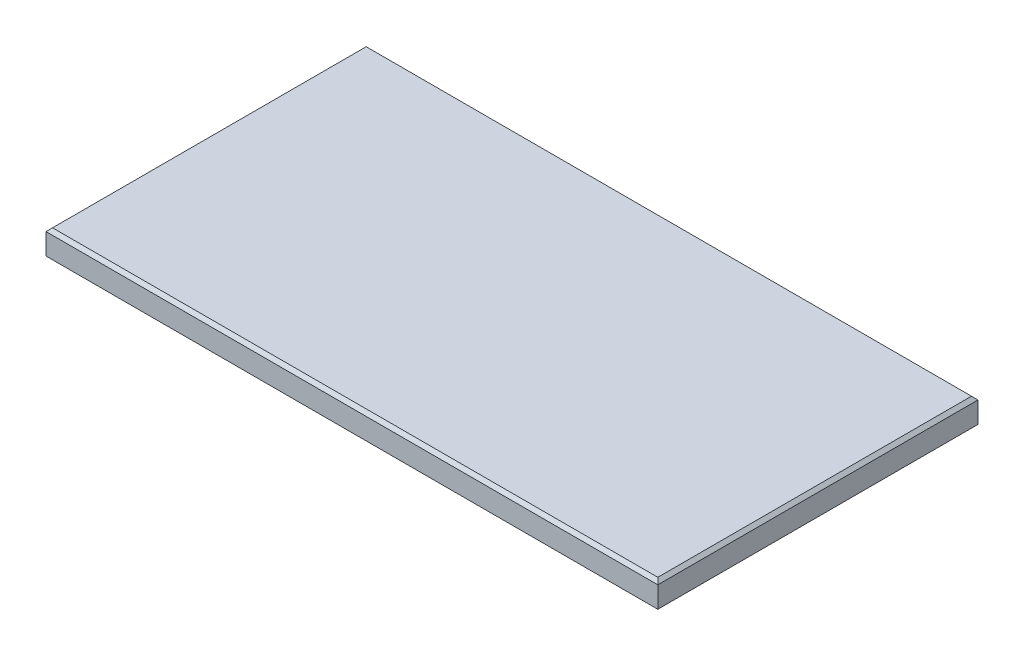
ISO-10303-21;
HEADER;
FILE_DESCRIPTION(('STEP AP214'),'2;1');
FILE_NAME('part.step','',(''),(''),'','','');
FILE_SCHEMA(('AUTOMOTIVE_DESIGN { 1 0 10303 214 1 1 1 1 }'));
ENDSEC;
DATA;
#1=APPLICATION_CONTEXT('core data for automotive mechanical design processes');
#2=APPLICATION_PROTOCOL_DEFINITION('international standard','automotive_design',2000,#1);
#3=PRODUCT_CONTEXT('',#1,'mechanical');
#4=PRODUCT('Part','Part','',(#3));
#5=PRODUCT_RELATED_PRODUCT_CATEGORY('part','',(#4));
#6=PRODUCT_DEFINITION_FORMATION('','',#4);
#7=PRODUCT_DEFINITION_CONTEXT('part definition',#1,'design');
#8=PRODUCT_DEFINITION('design','',#6,#7);
#9=PRODUCT_DEFINITION_SHAPE('','',#8);
#10=(LENGTH_UNIT() NAMED_UNIT(*) SI_UNIT(.MILLI.,.METRE.));
#11=(NAMED_UNIT(*) PLANE_ANGLE_UNIT() SI_UNIT($,.RADIAN.));
#12=(NAMED_UNIT(*) SI_UNIT($,.STERADIAN.) SOLID_ANGLE_UNIT());
#13=UNCERTAINTY_MEASURE_WITH_UNIT(LENGTH_MEASURE(1.E-05),#10,'distance_accuracy_value','');
#14=(GEOMETRIC_REPRESENTATION_CONTEXT(3) GLOBAL_UNCERTAINTY_ASSIGNED_CONTEXT((#13)) GLOBAL_UNIT_ASSIGNED_CONTEXT((#10,
#11,#12)) REPRESENTATION_CONTEXT('',''));
#15=CARTESIAN_POINT('',(0.,0.,0.));
#16=DIRECTION('',(0.,0.,1.));
#17=DIRECTION('',(1.,0.,0.));
#18=AXIS2_PLACEMENT_3D('',#15,#16,#17);
#19=CARTESIAN_POINT('',(0.,19.05,0.));
#20=DIRECTION('',(1.,0.,0.));
#21=DIRECTION('',(0.,0.,-1.));
#22=AXIS2_PLACEMENT_3D('',#19,#20,#21);
#23=PLANE('',#22);
#24=DIRECTION('',(0.,-1.,0.));
#25=VECTOR('',#24,1.);
#26=CARTESIAN_POINT('',(0.,19.05,0.));
#27=LINE('',#26,#25);
#28=CARTESIAN_POINT('',(0.,16.5100000000001,0.));
#29=VERTEX_POINT('',#28);
#30=CARTESIAN_POINT('',(0.,0.,0.));
#31=VERTEX_POINT('',#30);
#32=EDGE_CURVE('E93',#29,#31,#27,.T.);
#33=ORIENTED_EDGE('',*,*,#32,.F.);
#34=DIRECTION('',(0.,0.,-1.));
#35=VECTOR('',#34,1.);
#36=CARTESIAN_POINT('',(0.,16.5100000000001,0.));
#37=LINE('',#36,#35);
#38=CARTESIAN_POINT('',(0.,16.5100000000001,-249.2375));
#39=VERTEX_POINT('',#38);
#40=EDGE_CURVE('E11',#29,#39,#37,.T.);
#41=ORIENTED_EDGE('',*,*,#40,.T.);
#42=DIRECTION('',(0.,-1.,0.));
#43=VECTOR('',#42,1.);
#44=CARTESIAN_POINT('',(0.,19.05,-249.2375));
#45=LINE('',#44,#43);
#46=CARTESIAN_POINT('',(0.,0.,-249.2375));
#47=VERTEX_POINT('',#46);
#48=EDGE_CURVE('E113',#39,#47,#45,.T.);
#49=ORIENTED_EDGE('',*,*,#48,.T.);
#50=DIRECTION('',(0.,0.,1.));
#51=VECTOR('',#50,1.);
#52=CARTESIAN_POINT('',(0.,0.,0.));
#53=LINE('',#52,#51);
#54=EDGE_CURVE('E108',#47,#31,#53,.T.);
#55=ORIENTED_EDGE('',*,*,#54,.T.);
#56=EDGE_LOOP('',(#33,#41,#49,#55));
#57=FACE_BOUND('',#56,.T.);
#58=ADVANCED_FACE('F40',(#57),#23,.F.);
#59=CARTESIAN_POINT('',(0.,19.05,0.));
#60=DIRECTION('',(0.,0.,-1.));
#61=DIRECTION('',(-1.,0.,0.));
#62=AXIS2_PLACEMENT_3D('',#59,#60,#61);
#63=PLANE('',#62);
#64=DIRECTION('',(0.,-1.,0.));
#65=VECTOR('',#64,1.);
#66=CARTESIAN_POINT('',(476.25,19.05,0.));
#67=LINE('',#66,#65);
#68=CARTESIAN_POINT('',(476.25,16.5100000000001,0.));
#69=VERTEX_POINT('',#68);
#70=CARTESIAN_POINT('',(476.25,0.,0.));
#71=VERTEX_POINT('',#70);
#72=EDGE_CURVE('E102',#69,#71,#67,.T.);
#73=ORIENTED_EDGE('',*,*,#72,.F.);
#74=DIRECTION('',(-1.,0.,0.));
#75=VECTOR('',#74,1.);
#76=CARTESIAN_POINT('',(0.,16.5100000000001,0.));
#77=LINE('',#76,#75);
#78=EDGE_CURVE('E50',#69,#29,#77,.T.);
#79=ORIENTED_EDGE('',*,*,#78,.T.);
#80=ORIENTED_EDGE('',*,*,#32,.T.);
#81=DIRECTION('',(1.,0.,0.));
#82=VECTOR('',#81,1.);
#83=CARTESIAN_POINT('',(0.,0.,0.));
#84=LINE('',#83,#82);
#85=EDGE_CURVE('E96',#31,#71,#84,.T.);
#86=ORIENTED_EDGE('',*,*,#85,.T.);
#87=EDGE_LOOP('',(#73,#79,#80,#86));
#88=FACE_BOUND('',#87,.T.);
#89=ADVANCED_FACE('F95',(#88),#63,.F.);
#90=CARTESIAN_POINT('',(476.25,19.05,0.));
#91=DIRECTION('',(-1.,0.,0.));
#92=DIRECTION('',(0.,0.,1.));
#93=AXIS2_PLACEMENT_3D('',#90,#91,#92);
#94=PLANE('',#93);
#95=DIRECTION('',(0.,-1.,0.));
#96=VECTOR('',#95,1.);
#97=CARTESIAN_POINT('',(476.25,19.05,-249.2375));
#98=LINE('',#97,#96);
#99=CARTESIAN_POINT('',(476.25,16.5100000000001,-249.2375));
#100=VERTEX_POINT('',#99);
#101=CARTESIAN_POINT('',(476.25,0.,-249.2375));
#102=VERTEX_POINT('',#101);
#103=EDGE_CURVE('E123',#100,#102,#98,.T.);
#104=ORIENTED_EDGE('',*,*,#103,.F.);
#105=DIRECTION('',(0.,0.,1.));
#106=VECTOR('',#105,1.);
#107=CARTESIAN_POINT('',(476.25,16.5100000000001,0.));
#108=LINE('',#107,#106);
#109=EDGE_CURVE('E65',#100,#69,#108,.T.);
#110=ORIENTED_EDGE('',*,*,#109,.T.);
#111=ORIENTED_EDGE('',*,*,#72,.T.);
#112=DIRECTION('',(0.,0.,-1.));
#113=VECTOR('',#112,1.);
#114=CARTESIAN_POINT('',(476.25,0.,0.));
#115=LINE('',#114,#113);
#116=EDGE_CURVE('E110',#71,#102,#115,.T.);
#117=ORIENTED_EDGE('',*,*,#116,.T.);
#118=EDGE_LOOP('',(#104,#110,#111,#117));
#119=FACE_BOUND('',#118,.T.);
#120=ADVANCED_FACE('F161',(#119),#94,.F.);
#121=CARTESIAN_POINT('',(0.,19.05,-249.2375));
#122=DIRECTION('',(0.,0.,1.));
#123=DIRECTION('',(1.,0.,0.));
#124=AXIS2_PLACEMENT_3D('',#121,#122,#123);
#125=PLANE('',#124);
#126=ORIENTED_EDGE('',*,*,#48,.F.);
#127=DIRECTION('',(1.,0.,0.));
#128=VECTOR('',#127,1.);
#129=CARTESIAN_POINT('',(0.,16.5100000000001,-249.2375));
#130=LINE('',#129,#128);
#131=EDGE_CURVE('E134',#39,#100,#130,.T.);
#132=ORIENTED_EDGE('',*,*,#131,.T.);
#133=ORIENTED_EDGE('',*,*,#103,.T.);
#134=DIRECTION('',(-1.,0.,0.));
#135=VECTOR('',#134,1.);
#136=CARTESIAN_POINT('',(0.,0.,-249.2375));
#137=LINE('',#136,#135);
#138=EDGE_CURVE('E120',#102,#47,#137,.T.);
#139=ORIENTED_EDGE('',*,*,#138,.T.);
#140=EDGE_LOOP('',(#126,#132,#133,#139));
#141=FACE_BOUND('',#140,.T.);
#142=ADVANCED_FACE('F160',(#141),#125,.F.);
#143=CARTESIAN_POINT('',(0.,19.05,0.));
#144=DIRECTION('',(0.,-1.,0.));
#145=DIRECTION('',(0.,0.,-1.));
#146=AXIS2_PLACEMENT_3D('',#143,#144,#145);
#147=PLANE('',#146);
#148=DIRECTION('',(0.,0.,-1.));
#149=VECTOR('',#148,1.);
#150=CARTESIAN_POINT('',(473.71,19.05,0.));
#151=LINE('',#150,#149);
#152=CARTESIAN_POINT('',(473.71,19.05,-2.53999999999993));
#153=VERTEX_POINT('',#152);
#154=CARTESIAN_POINT('',(473.71,19.05,-246.6975));
#155=VERTEX_POINT('',#154);
#156=EDGE_CURVE('E129',#153,#155,#151,.T.);
#157=ORIENTED_EDGE('',*,*,#156,.T.);
#158=DIRECTION('',(-1.,0.,0.));
#159=VECTOR('',#158,1.);
#160=CARTESIAN_POINT('',(0.,19.05,-246.6975));
#161=LINE('',#160,#159);
#162=CARTESIAN_POINT('',(2.53999999999993,19.05,-246.6975));
#163=VERTEX_POINT('',#162);
#164=EDGE_CURVE('E131',#155,#163,#161,.T.);
#165=ORIENTED_EDGE('',*,*,#164,.T.);
#166=DIRECTION('',(0.,0.,1.));
#167=VECTOR('',#166,1.);
#168=CARTESIAN_POINT('',(2.53999999999993,19.05,0.));
#169=LINE('',#168,#167);
#170=CARTESIAN_POINT('',(2.53999999999993,19.05,-2.53999999999993));
#171=VERTEX_POINT('',#170);
#172=EDGE_CURVE('E101',#163,#171,#169,.T.);
#173=ORIENTED_EDGE('',*,*,#172,.T.);
#174=DIRECTION('',(1.,0.,0.));
#175=VECTOR('',#174,1.);
#176=CARTESIAN_POINT('',(0.,19.05,-2.53999999999993));
#177=LINE('',#176,#175);
#178=EDGE_CURVE('E127',#171,#153,#177,.T.);
#179=ORIENTED_EDGE('',*,*,#178,.T.);
#180=EDGE_LOOP('',(#157,#165,#173,#179));
#181=FACE_BOUND('',#180,.T.);
#182=ADVANCED_FACE('F153',(#181),#147,.F.);
#183=CARTESIAN_POINT('',(0.,0.,0.));
#184=DIRECTION('',(0.,-1.,0.));
#185=DIRECTION('',(0.,0.,-1.));
#186=AXIS2_PLACEMENT_3D('',#183,#184,#185);
#187=PLANE('',#186);
#188=ORIENTED_EDGE('',*,*,#54,.F.);
#189=ORIENTED_EDGE('',*,*,#138,.F.);
#190=ORIENTED_EDGE('',*,*,#116,.F.);
#191=ORIENTED_EDGE('',*,*,#85,.F.);
#192=EDGE_LOOP('',(#188,#189,#190,#191));
#193=FACE_BOUND('',#192,.T.);
#194=ADVANCED_FACE('F106',(#193),#187,.T.);
#195=CARTESIAN_POINT('',(0.,19.05,-2.53999999999993));
#196=DIRECTION('',(0.,-0.707106781186547,-0.707106781186548));
#197=DIRECTION('',(1.,0.,0.));
#198=AXIS2_PLACEMENT_3D('',#195,#196,#197);
#199=PLANE('',#198);
#200=DIRECTION('',(0.577350269189626,0.577350269189626,-0.577350269189626));
#201=VECTOR('',#200,1.);
#202=CARTESIAN_POINT('',(1.69333333333329,18.2033333333334,-1.69333333333329));
#203=LINE('',#202,#201);
#204=EDGE_CURVE('E117',#29,#171,#203,.T.);
#205=ORIENTED_EDGE('',*,*,#204,.F.);
#206=ORIENTED_EDGE('',*,*,#78,.F.);
#207=DIRECTION('',(-0.577350269189626,0.577350269189626,-0.577350269189626));
#208=VECTOR('',#207,1.);
#209=CARTESIAN_POINT('',(315.806666666667,176.953333333333,-160.443333333333));
#210=LINE('',#209,#208);
#211=EDGE_CURVE('E45',#153,#69,#210,.F.);
#212=ORIENTED_EDGE('',*,*,#211,.F.);
#213=ORIENTED_EDGE('',*,*,#178,.F.);
#214=EDGE_LOOP('',(#205,#206,#212,#213));
#215=FACE_BOUND('',#214,.T.);
#216=ADVANCED_FACE('F43',(#215),#199,.F.);
#217=CARTESIAN_POINT('',(473.71,19.05,0.));
#218=DIRECTION('',(-0.707106781186548,-0.707106781186548,0.));
#219=DIRECTION('',(0.,0.,-1.));
#220=AXIS2_PLACEMENT_3D('',#217,#218,#219);
#221=PLANE('',#220);
#222=ORIENTED_EDGE('',*,*,#211,.T.);
#223=ORIENTED_EDGE('',*,*,#109,.F.);
#224=DIRECTION('',(-0.577350269189626,0.577350269189626,0.577350269189626));
#225=VECTOR('',#224,1.);
#226=CARTESIAN_POINT('',(391.4775,101.2825,-164.465));
#227=LINE('',#226,#225);
#228=EDGE_CURVE('E141',#155,#100,#227,.F.);
#229=ORIENTED_EDGE('',*,*,#228,.F.);
#230=ORIENTED_EDGE('',*,*,#156,.F.);
#231=EDGE_LOOP('',(#222,#223,#229,#230));
#232=FACE_BOUND('',#231,.T.);
#233=ADVANCED_FACE('F186',(#232),#221,.F.);
#234=CARTESIAN_POINT('',(2.53999999999993,19.05,0.));
#235=DIRECTION('',(0.707106781186548,-0.707106781186547,0.));
#236=DIRECTION('',(0.,0.,1.));
#237=AXIS2_PLACEMENT_3D('',#234,#235,#236);
#238=PLANE('',#237);
#239=ORIENTED_EDGE('',*,*,#204,.T.);
#240=ORIENTED_EDGE('',*,*,#172,.F.);
#241=DIRECTION('',(-0.577350269189626,-0.577350269189626,-0.577350269189626));
#242=VECTOR('',#241,1.);
#243=CARTESIAN_POINT('',(84.7725,101.2825,-164.465));
#244=LINE('',#243,#242);
#245=EDGE_CURVE('E139',#39,#163,#244,.F.);
#246=ORIENTED_EDGE('',*,*,#245,.F.);
#247=ORIENTED_EDGE('',*,*,#40,.F.);
#248=EDGE_LOOP('',(#239,#240,#246,#247));
#249=FACE_BOUND('',#248,.T.);
#250=ADVANCED_FACE('F146',(#249),#238,.F.);
#251=CARTESIAN_POINT('',(0.,19.05,-246.6975));
#252=DIRECTION('',(0.,-0.707106781186548,0.707106781186548));
#253=DIRECTION('',(-1.,0.,0.));
#254=AXIS2_PLACEMENT_3D('',#251,#252,#253);
#255=PLANE('',#254);
#256=ORIENTED_EDGE('',*,*,#228,.T.);
#257=ORIENTED_EDGE('',*,*,#131,.F.);
#258=ORIENTED_EDGE('',*,*,#245,.T.);
#259=ORIENTED_EDGE('',*,*,#164,.F.);
#260=EDGE_LOOP('',(#256,#257,#258,#259));
#261=FACE_BOUND('',#260,.T.);
#262=ADVANCED_FACE('F157',(#261),#255,.F.);
#263=CLOSED_SHELL('',(#58,#89,#120,#142,#182,#194,#216,#233,#250,#262));
#264=MANIFOLD_SOLID_BREP('B2',#263);
#265=ADVANCED_BREP_SHAPE_REPRESENTATION('',(#18,#264),#14);
#266=SHAPE_DEFINITION_REPRESENTATION(#9,#265);
ENDSEC;
END-ISO-10303-21;
